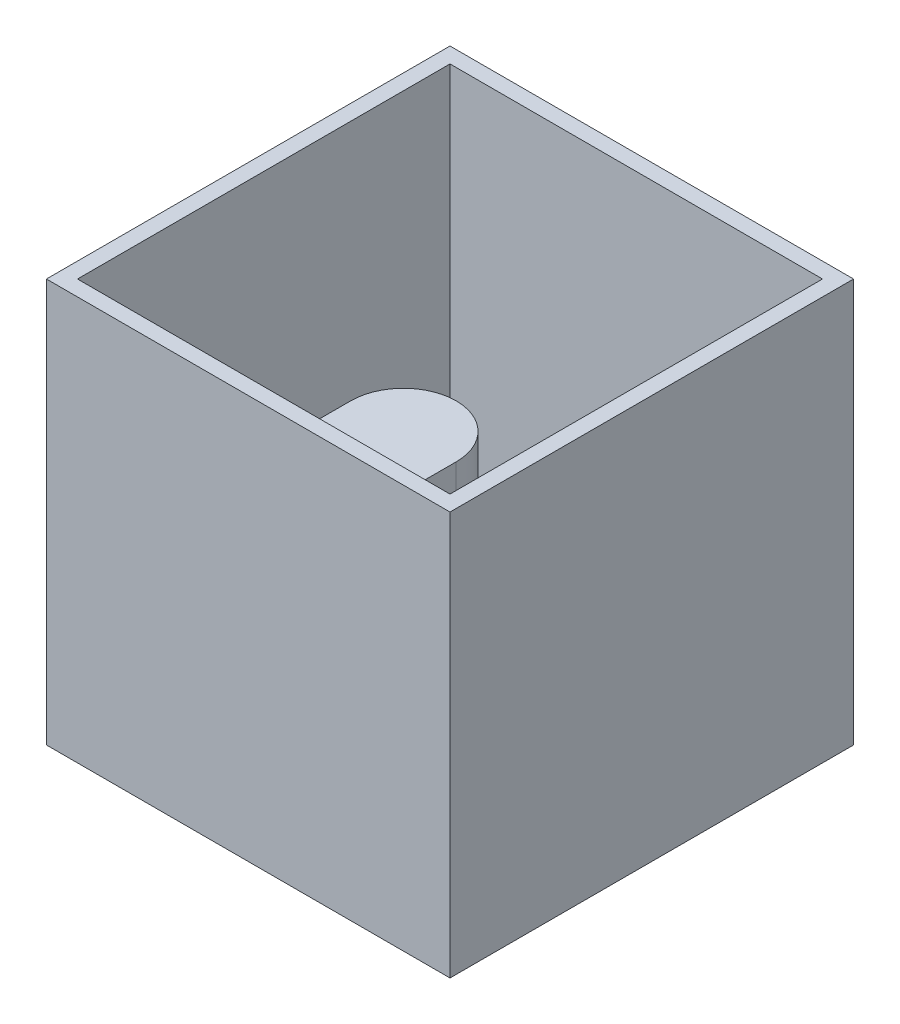
ISO-10303-21;
HEADER;
FILE_DESCRIPTION(('STEP AP214'),'2;1');
FILE_NAME('part.step','',(''),(''),'','','');
FILE_SCHEMA(('AUTOMOTIVE_DESIGN { 1 0 10303 214 1 1 1 1 }'));
ENDSEC;
DATA;
#1=APPLICATION_CONTEXT('core data for automotive mechanical design processes');
#2=APPLICATION_PROTOCOL_DEFINITION('international standard','automotive_design',2000,#1);
#3=PRODUCT_CONTEXT('',#1,'mechanical');
#4=PRODUCT('Part','Part','',(#3));
#5=PRODUCT_RELATED_PRODUCT_CATEGORY('part','',(#4));
#6=PRODUCT_DEFINITION_FORMATION('','',#4);
#7=PRODUCT_DEFINITION_CONTEXT('part definition',#1,'design');
#8=PRODUCT_DEFINITION('design','',#6,#7);
#9=PRODUCT_DEFINITION_SHAPE('','',#8);
#10=(LENGTH_UNIT() NAMED_UNIT(*) SI_UNIT(.MILLI.,.METRE.));
#11=(NAMED_UNIT(*) PLANE_ANGLE_UNIT() SI_UNIT($,.RADIAN.));
#12=(NAMED_UNIT(*) SI_UNIT($,.STERADIAN.) SOLID_ANGLE_UNIT());
#13=UNCERTAINTY_MEASURE_WITH_UNIT(LENGTH_MEASURE(1.E-05),#10,'distance_accuracy_value','');
#14=(GEOMETRIC_REPRESENTATION_CONTEXT(3) GLOBAL_UNCERTAINTY_ASSIGNED_CONTEXT((#13)) GLOBAL_UNIT_ASSIGNED_CONTEXT((#10,
#11,#12)) REPRESENTATION_CONTEXT('',''));
#15=CARTESIAN_POINT('',(0.,0.,0.));
#16=DIRECTION('',(0.,0.,1.));
#17=DIRECTION('',(1.,0.,0.));
#18=AXIS2_PLACEMENT_3D('',#15,#16,#17);
#19=CARTESIAN_POINT('',(0.,1.,0.));
#20=DIRECTION('',(0.,1.,0.));
#21=DIRECTION('',(0.,0.,1.));
#22=AXIS2_PLACEMENT_3D('',#19,#20,#21);
#23=PLANE('',#22);
#24=DIRECTION('',(1.,0.,0.));
#25=VECTOR('',#24,1.);
#26=CARTESIAN_POINT('',(0.,1.,5.84487474981654));
#27=LINE('',#26,#25);
#28=CARTESIAN_POINT('',(5.499999952,1.,5.84487474981654));
#29=VERTEX_POINT('',#28);
#30=CARTESIAN_POINT('',(9.499999952,1.,5.84487474981654));
#31=VERTEX_POINT('',#30);
#32=EDGE_CURVE('E324',#29,#31,#27,.T.);
#33=ORIENTED_EDGE('',*,*,#32,.T.);
#34=CARTESIAN_POINT('',(6.04891316665253,1.,-13.8551252501835));
#35=DIRECTION('',(0.,1.,0.));
#36=DIRECTION('',(0.,0.,1.));
#37=AXIS2_PLACEMENT_3D('',#34,#35,#36);
#38=CIRCLE('',#37,20.);
#39=CARTESIAN_POINT('',(6.04891316665253,1.,6.14487474981654));
#40=VERTEX_POINT('',#39);
#41=EDGE_CURVE('E43',#31,#40,#38,.F.);
#42=ORIENTED_EDGE('',*,*,#41,.T.);
#43=DIRECTION('',(1.,0.,0.));
#44=VECTOR('',#43,1.);
#45=CARTESIAN_POINT('',(0.,1.,6.14487474981654));
#46=LINE('',#45,#44);
#47=CARTESIAN_POINT('',(5.199999952,1.,6.14487474981654));
#48=VERTEX_POINT('',#47);
#49=EDGE_CURVE('E283',#48,#40,#46,.T.);
#50=ORIENTED_EDGE('',*,*,#49,.F.);
#51=DIRECTION('',(0.,0.,1.));
#52=VECTOR('',#51,1.);
#53=CARTESIAN_POINT('',(5.199999952,1.,0.));
#54=LINE('',#53,#52);
#55=CARTESIAN_POINT('',(5.199999952,1.,5.84144096362461));
#56=VERTEX_POINT('',#55);
#57=EDGE_CURVE('E280',#56,#48,#54,.T.);
#58=ORIENTED_EDGE('',*,*,#57,.F.);
#59=CARTESIAN_POINT('',(2.499999952,1.,5.84144096362461));
#60=DIRECTION('',(0.,-1.,0.));
#61=DIRECTION('',(0.,0.,-1.));
#62=AXIS2_PLACEMENT_3D('',#59,#60,#61);
#63=CIRCLE('',#62,2.7);
#64=CARTESIAN_POINT('',(-0.200000048,1.,5.84144096362461));
#65=VERTEX_POINT('',#64);
#66=EDGE_CURVE('E277',#65,#56,#63,.T.);
#67=ORIENTED_EDGE('',*,*,#66,.F.);
#68=DIRECTION('',(0.,0.,-1.));
#69=VECTOR('',#68,1.);
#70=CARTESIAN_POINT('',(-0.200000047999999,1.,0.));
#71=LINE('',#70,#69);
#72=CARTESIAN_POINT('',(-0.200000048,1.,7.84144096362461));
#73=VERTEX_POINT('',#72);
#74=EDGE_CURVE('E274',#73,#65,#71,.T.);
#75=ORIENTED_EDGE('',*,*,#74,.F.);
#76=CARTESIAN_POINT('',(2.499999952,1.,7.84144096362461));
#77=DIRECTION('',(0.,-1.,0.));
#78=DIRECTION('',(0.,0.,-1.));
#79=AXIS2_PLACEMENT_3D('',#76,#77,#78);
#80=CIRCLE('',#79,2.7);
#81=CARTESIAN_POINT('',(5.199999952,1.,7.84144096362461));
#82=VERTEX_POINT('',#81);
#83=EDGE_CURVE('E271',#82,#73,#80,.T.);
#84=ORIENTED_EDGE('',*,*,#83,.F.);
#85=DIRECTION('',(0.,0.,1.));
#86=VECTOR('',#85,1.);
#87=CARTESIAN_POINT('',(5.199999952,1.,0.));
#88=LINE('',#87,#86);
#89=CARTESIAN_POINT('',(5.199999952,1.,7.29891537461033));
#90=VERTEX_POINT('',#89);
#91=EDGE_CURVE('E267',#90,#82,#88,.T.);
#92=ORIENTED_EDGE('',*,*,#91,.F.);
#93=DIRECTION('',(1.,0.,0.));
#94=VECTOR('',#93,1.);
#95=CARTESIAN_POINT('',(0.,1.,7.29891537461033));
#96=LINE('',#95,#94);
#97=CARTESIAN_POINT('',(6.04891316665253,1.,7.29891537461033));
#98=VERTEX_POINT('',#97);
#99=EDGE_CURVE('E264',#90,#98,#96,.T.);
#100=ORIENTED_EDGE('',*,*,#99,.T.);
#101=CARTESIAN_POINT('',(6.04891316665253,1.,27.2989153746103));
#102=DIRECTION('',(0.,1.,0.));
#103=DIRECTION('',(0.,0.,1.));
#104=AXIS2_PLACEMENT_3D('',#101,#102,#103);
#105=CIRCLE('',#104,20.);
#106=CARTESIAN_POINT('',(9.499999952,1.,7.59891537461033));
#107=VERTEX_POINT('',#106);
#108=EDGE_CURVE('E446',#98,#107,#105,.F.);
#109=ORIENTED_EDGE('',*,*,#108,.T.);
#110=DIRECTION('',(1.,0.,0.));
#111=VECTOR('',#110,1.);
#112=CARTESIAN_POINT('',(0.,1.,7.59891537461033));
#113=LINE('',#112,#111);
#114=CARTESIAN_POINT('',(5.499999952,1.,7.59891537461033));
#115=VERTEX_POINT('',#114);
#116=EDGE_CURVE('E321',#115,#107,#113,.T.);
#117=ORIENTED_EDGE('',*,*,#116,.F.);
#118=DIRECTION('',(0.,0.,1.));
#119=VECTOR('',#118,1.);
#120=CARTESIAN_POINT('',(5.499999952,1.,0.));
#121=LINE('',#120,#119);
#122=CARTESIAN_POINT('',(5.499999952,1.,7.84144096362461));
#123=VERTEX_POINT('',#122);
#124=EDGE_CURVE('E318',#115,#123,#121,.T.);
#125=ORIENTED_EDGE('',*,*,#124,.T.);
#126=CARTESIAN_POINT('',(2.499999952,1.,7.84144096362461));
#127=DIRECTION('',(0.,1.,0.));
#128=DIRECTION('',(0.,0.,1.));
#129=AXIS2_PLACEMENT_3D('',#126,#127,#128);
#130=CIRCLE('',#129,3.);
#131=CARTESIAN_POINT('',(2.499999952,1.,10.8414409636246));
#132=VERTEX_POINT('',#131);
#133=EDGE_CURVE('E423',#123,#132,#130,.F.);
#134=ORIENTED_EDGE('',*,*,#133,.T.);
#135=CARTESIAN_POINT('',(2.499999952,1.,7.84144096362461));
#136=DIRECTION('',(0.,1.,0.));
#137=DIRECTION('',(0.,0.,1.));
#138=AXIS2_PLACEMENT_3D('',#135,#136,#137);
#139=CIRCLE('',#138,3.);
#140=CARTESIAN_POINT('',(-0.500000048,1.,7.84144096362461));
#141=VERTEX_POINT('',#140);
#142=EDGE_CURVE('E427',#132,#141,#139,.F.);
#143=ORIENTED_EDGE('',*,*,#142,.T.);
#144=DIRECTION('',(0.,0.,1.));
#145=VECTOR('',#144,1.);
#146=CARTESIAN_POINT('',(-0.500000048000001,1.,0.));
#147=LINE('',#146,#145);
#148=CARTESIAN_POINT('',(-0.500000048,1.,5.84144096362461));
#149=VERTEX_POINT('',#148);
#150=EDGE_CURVE('E316',#149,#141,#147,.T.);
#151=ORIENTED_EDGE('',*,*,#150,.F.);
#152=CARTESIAN_POINT('',(2.499999952,1.,5.84144096362461));
#153=DIRECTION('',(0.,1.,0.));
#154=DIRECTION('',(0.,0.,1.));
#155=AXIS2_PLACEMENT_3D('',#152,#153,#154);
#156=CIRCLE('',#155,3.);
#157=CARTESIAN_POINT('',(2.499999952,1.,2.84144096362461));
#158=VERTEX_POINT('',#157);
#159=EDGE_CURVE('E431',#149,#158,#156,.F.);
#160=ORIENTED_EDGE('',*,*,#159,.T.);
#161=CARTESIAN_POINT('',(2.499999952,1.,5.84144096362461));
#162=DIRECTION('',(0.,1.,0.));
#163=DIRECTION('',(0.,0.,1.));
#164=AXIS2_PLACEMENT_3D('',#161,#162,#163);
#165=CIRCLE('',#164,3.);
#166=CARTESIAN_POINT('',(5.499999952,1.,5.84144096362461));
#167=VERTEX_POINT('',#166);
#168=EDGE_CURVE('E435',#158,#167,#165,.F.);
#169=ORIENTED_EDGE('',*,*,#168,.T.);
#170=EDGE_CURVE('E314',#167,#29,#121,.T.);
#171=ORIENTED_EDGE('',*,*,#170,.T.);
#172=EDGE_LOOP('',(#33,#42,#50,#58,#67,#75,#84,#92,#100,#109,#117,#125,#134,#143,#151,#160,#169,#171));
#173=FACE_BOUND('',#172,.T.);
#174=DIRECTION('',(1.,0.,0.));
#175=VECTOR('',#174,1.);
#176=CARTESIAN_POINT('',(0.,1.,12.8414409636246));
#177=LINE('',#176,#175);
#178=CARTESIAN_POINT('',(-1.,1.,12.8414409636246));
#179=VERTEX_POINT('',#178);
#180=CARTESIAN_POINT('',(11.,1.,12.8414409636246));
#181=VERTEX_POINT('',#180);
#182=EDGE_CURVE('E348',#179,#181,#177,.T.);
#183=ORIENTED_EDGE('',*,*,#182,.T.);
#184=DIRECTION('',(0.,0.,-1.));
#185=VECTOR('',#184,1.);
#186=CARTESIAN_POINT('',(11.,1.,0.));
#187=LINE('',#186,#185);
#188=CARTESIAN_POINT('',(11.,1.,0.841440963624613));
#189=VERTEX_POINT('',#188);
#190=EDGE_CURVE('E350',#181,#189,#187,.T.);
#191=ORIENTED_EDGE('',*,*,#190,.T.);
#192=DIRECTION('',(1.,0.,0.));
#193=VECTOR('',#192,1.);
#194=CARTESIAN_POINT('',(0.,1.,0.841440963624613));
#195=LINE('',#194,#193);
#196=CARTESIAN_POINT('',(-1.,1.,0.841440963624613));
#197=VERTEX_POINT('',#196);
#198=EDGE_CURVE('E352',#197,#189,#195,.T.);
#199=ORIENTED_EDGE('',*,*,#198,.F.);
#200=DIRECTION('',(0.,0.,-1.));
#201=VECTOR('',#200,1.);
#202=CARTESIAN_POINT('',(-1.,1.,0.));
#203=LINE('',#202,#201);
#204=EDGE_CURVE('E355',#179,#197,#203,.T.);
#205=ORIENTED_EDGE('',*,*,#204,.F.);
#206=EDGE_LOOP('',(#183,#191,#199,#205));
#207=FACE_BOUND('',#206,.T.);
#208=DIRECTION('',(0.,0.,1.));
#209=VECTOR('',#208,1.);
#210=CARTESIAN_POINT('',(0.799999952,1.,5.84144096362461));
#211=LINE('',#210,#209);
#212=CARTESIAN_POINT('',(0.799999952,1.,5.84144096362461));
#213=VERTEX_POINT('',#212);
#214=CARTESIAN_POINT('',(0.799999952,1.,7.84144096362461));
#215=VERTEX_POINT('',#214);
#216=EDGE_CURVE('E868',#213,#215,#211,.T.);
#217=ORIENTED_EDGE('',*,*,#216,.F.);
#218=CARTESIAN_POINT('',(2.499999952,1.,5.84144096362461));
#219=DIRECTION('',(0.,1.,0.));
#220=DIRECTION('',(0.,0.,1.));
#221=AXIS2_PLACEMENT_3D('',#218,#219,#220);
#222=CIRCLE('',#221,1.7);
#223=CARTESIAN_POINT('',(4.199999952,1.,5.84144096362461));
#224=VERTEX_POINT('',#223);
#225=EDGE_CURVE('E254',#224,#213,#222,.T.);
#226=ORIENTED_EDGE('',*,*,#225,.F.);
#227=DIRECTION('',(0.,0.,-1.));
#228=VECTOR('',#227,1.);
#229=CARTESIAN_POINT('',(4.199999952,1.,5.84144096362461));
#230=LINE('',#229,#228);
#231=CARTESIAN_POINT('',(4.199999952,1.,7.84144096362461));
#232=VERTEX_POINT('',#231);
#233=EDGE_CURVE('E250',#232,#224,#230,.T.);
#234=ORIENTED_EDGE('',*,*,#233,.F.);
#235=CARTESIAN_POINT('',(2.499999952,1.,7.84144096362461));
#236=DIRECTION('',(0.,1.,0.));
#237=DIRECTION('',(0.,0.,1.));
#238=AXIS2_PLACEMENT_3D('',#235,#236,#237);
#239=CIRCLE('',#238,1.7);
#240=EDGE_CURVE('E865',#215,#232,#239,.T.);
#241=ORIENTED_EDGE('',*,*,#240,.F.);
#242=EDGE_LOOP('',(#217,#226,#234,#241));
#243=FACE_BOUND('',#242,.T.);
#244=ADVANCED_FACE('F35',(#173,#207,#243),#23,.T.);
#245=CARTESIAN_POINT('',(11.,13.,0.));
#246=DIRECTION('',(-1.,0.,0.));
#247=DIRECTION('',(0.,0.,1.));
#248=AXIS2_PLACEMENT_3D('',#245,#246,#247);
#249=PLANE('',#248);
#250=ORIENTED_EDGE('',*,*,#190,.F.);
#251=DIRECTION('',(0.,-1.,0.));
#252=VECTOR('',#251,1.);
#253=CARTESIAN_POINT('',(11.,13.,12.8414409636246));
#254=LINE('',#253,#252);
#255=CARTESIAN_POINT('',(11.,13.,12.8414409636246));
#256=VERTEX_POINT('',#255);
#257=EDGE_CURVE('E401',#256,#181,#254,.T.);
#258=ORIENTED_EDGE('',*,*,#257,.F.);
#259=DIRECTION('',(0.,0.,-1.));
#260=VECTOR('',#259,1.);
#261=CARTESIAN_POINT('',(11.,13.,0.));
#262=LINE('',#261,#260);
#263=CARTESIAN_POINT('',(11.,13.,0.841440963624613));
#264=VERTEX_POINT('',#263);
#265=EDGE_CURVE('E370',#256,#264,#262,.T.);
#266=ORIENTED_EDGE('',*,*,#265,.T.);
#267=DIRECTION('',(0.,-1.,0.));
#268=VECTOR('',#267,1.);
#269=CARTESIAN_POINT('',(11.,13.,0.841440963624613));
#270=LINE('',#269,#268);
#271=EDGE_CURVE('E391',#264,#189,#270,.T.);
#272=ORIENTED_EDGE('',*,*,#271,.T.);
#273=EDGE_LOOP('',(#250,#258,#266,#272));
#274=FACE_BOUND('',#273,.T.);
#275=ADVANCED_FACE('F541',(#274),#249,.T.);
#276=CARTESIAN_POINT('',(0.,13.,12.8414409636246));
#277=DIRECTION('',(0.,0.,-1.));
#278=DIRECTION('',(-1.,0.,0.));
#279=AXIS2_PLACEMENT_3D('',#276,#277,#278);
#280=PLANE('',#279);
#281=ORIENTED_EDGE('',*,*,#182,.F.);
#282=DIRECTION('',(0.,-1.,0.));
#283=VECTOR('',#282,1.);
#284=CARTESIAN_POINT('',(-1.,13.,12.8414409636246));
#285=LINE('',#284,#283);
#286=CARTESIAN_POINT('',(-1.,13.,12.8414409636246));
#287=VERTEX_POINT('',#286);
#288=EDGE_CURVE('E398',#287,#179,#285,.T.);
#289=ORIENTED_EDGE('',*,*,#288,.F.);
#290=DIRECTION('',(1.,0.,0.));
#291=VECTOR('',#290,1.);
#292=CARTESIAN_POINT('',(0.,13.,12.8414409636246));
#293=LINE('',#292,#291);
#294=EDGE_CURVE('E373',#287,#256,#293,.T.);
#295=ORIENTED_EDGE('',*,*,#294,.T.);
#296=ORIENTED_EDGE('',*,*,#257,.T.);
#297=EDGE_LOOP('',(#281,#289,#295,#296));
#298=FACE_BOUND('',#297,.T.);
#299=ADVANCED_FACE('F546',(#298),#280,.T.);
#300=CARTESIAN_POINT('',(-1.,13.,0.));
#301=DIRECTION('',(-1.,0.,0.));
#302=DIRECTION('',(0.,0.,1.));
#303=AXIS2_PLACEMENT_3D('',#300,#301,#302);
#304=PLANE('',#303);
#305=ORIENTED_EDGE('',*,*,#288,.T.);
#306=ORIENTED_EDGE('',*,*,#204,.T.);
#307=DIRECTION('',(0.,-1.,0.));
#308=VECTOR('',#307,1.);
#309=CARTESIAN_POINT('',(-1.,13.,0.841440963624613));
#310=LINE('',#309,#308);
#311=CARTESIAN_POINT('',(-1.,13.,0.841440963624613));
#312=VERTEX_POINT('',#311);
#313=EDGE_CURVE('E394',#312,#197,#310,.T.);
#314=ORIENTED_EDGE('',*,*,#313,.F.);
#315=DIRECTION('',(0.,0.,-1.));
#316=VECTOR('',#315,1.);
#317=CARTESIAN_POINT('',(-1.,13.,0.));
#318=LINE('',#317,#316);
#319=EDGE_CURVE('E376',#287,#312,#318,.T.);
#320=ORIENTED_EDGE('',*,*,#319,.F.);
#321=EDGE_LOOP('',(#305,#306,#314,#320));
#322=FACE_BOUND('',#321,.T.);
#323=ADVANCED_FACE('F563',(#322),#304,.F.);
#324=CARTESIAN_POINT('',(-1.5,13.,0.));
#325=DIRECTION('',(-1.,0.,0.));
#326=DIRECTION('',(0.,0.,1.));
#327=AXIS2_PLACEMENT_3D('',#324,#325,#326);
#328=PLANE('',#327);
#329=DIRECTION('',(0.,0.,-1.));
#330=VECTOR('',#329,1.);
#331=CARTESIAN_POINT('',(-1.5,0.,0.));
#332=LINE('',#331,#330);
#333=CARTESIAN_POINT('',(-1.5,0.,13.3414409636246));
#334=VERTEX_POINT('',#333);
#335=CARTESIAN_POINT('',(-1.5,0.,0.341440963624613));
#336=VERTEX_POINT('',#335);
#337=EDGE_CURVE('E358',#334,#336,#332,.T.);
#338=ORIENTED_EDGE('',*,*,#337,.F.);
#339=DIRECTION('',(0.,-1.,0.));
#340=VECTOR('',#339,1.);
#341=CARTESIAN_POINT('',(-1.5,13.,13.3414409636246));
#342=LINE('',#341,#340);
#343=CARTESIAN_POINT('',(-1.5,13.,13.3414409636246));
#344=VERTEX_POINT('',#343);
#345=EDGE_CURVE('E395',#344,#334,#342,.T.);
#346=ORIENTED_EDGE('',*,*,#345,.F.);
#347=DIRECTION('',(0.,0.,-1.));
#348=VECTOR('',#347,1.);
#349=CARTESIAN_POINT('',(-1.5,13.,0.));
#350=LINE('',#349,#348);
#351=CARTESIAN_POINT('',(-1.5,13.,0.341440963624613));
#352=VERTEX_POINT('',#351);
#353=EDGE_CURVE('E359',#344,#352,#350,.T.);
#354=ORIENTED_EDGE('',*,*,#353,.T.);
#355=DIRECTION('',(0.,-1.,0.));
#356=VECTOR('',#355,1.);
#357=CARTESIAN_POINT('',(-1.5,13.,0.341440963624613));
#358=LINE('',#357,#356);
#359=EDGE_CURVE('E381',#352,#336,#358,.T.);
#360=ORIENTED_EDGE('',*,*,#359,.T.);
#361=EDGE_LOOP('',(#338,#346,#354,#360));
#362=FACE_BOUND('',#361,.T.);
#363=ADVANCED_FACE('F566',(#362),#328,.T.);
#364=CARTESIAN_POINT('',(0.,13.,13.3414409636246));
#365=DIRECTION('',(0.,0.,-1.));
#366=DIRECTION('',(-1.,0.,0.));
#367=AXIS2_PLACEMENT_3D('',#364,#365,#366);
#368=PLANE('',#367);
#369=DIRECTION('',(1.,0.,0.));
#370=VECTOR('',#369,1.);
#371=CARTESIAN_POINT('',(0.,0.,13.3414409636246));
#372=LINE('',#371,#370);
#373=CARTESIAN_POINT('',(11.5,0.,13.3414409636246));
#374=VERTEX_POINT('',#373);
#375=EDGE_CURVE('E384',#334,#374,#372,.T.);
#376=ORIENTED_EDGE('',*,*,#375,.T.);
#377=DIRECTION('',(0.,-1.,0.));
#378=VECTOR('',#377,1.);
#379=CARTESIAN_POINT('',(11.5,13.,13.3414409636246));
#380=LINE('',#379,#378);
#381=CARTESIAN_POINT('',(11.5,13.,13.3414409636246));
#382=VERTEX_POINT('',#381);
#383=EDGE_CURVE('E408',#382,#374,#380,.T.);
#384=ORIENTED_EDGE('',*,*,#383,.F.);
#385=DIRECTION('',(1.,0.,0.));
#386=VECTOR('',#385,1.);
#387=CARTESIAN_POINT('',(0.,13.,13.3414409636246));
#388=LINE('',#387,#386);
#389=EDGE_CURVE('E362',#344,#382,#388,.T.);
#390=ORIENTED_EDGE('',*,*,#389,.F.);
#391=ORIENTED_EDGE('',*,*,#345,.T.);
#392=EDGE_LOOP('',(#376,#384,#390,#391));
#393=FACE_BOUND('',#392,.T.);
#394=ADVANCED_FACE('F577',(#393),#368,.F.);
#395=CARTESIAN_POINT('',(11.5,13.,0.));
#396=DIRECTION('',(-1.,0.,0.));
#397=DIRECTION('',(0.,0.,1.));
#398=AXIS2_PLACEMENT_3D('',#395,#396,#397);
#399=PLANE('',#398);
#400=DIRECTION('',(0.,0.,-1.));
#401=VECTOR('',#400,1.);
#402=CARTESIAN_POINT('',(11.5,0.,0.));
#403=LINE('',#402,#401);
#404=CARTESIAN_POINT('',(11.5,0.,0.341440963624613));
#405=VERTEX_POINT('',#404);
#406=EDGE_CURVE('E386',#374,#405,#403,.T.);
#407=ORIENTED_EDGE('',*,*,#406,.T.);
#408=DIRECTION('',(0.,-1.,0.));
#409=VECTOR('',#408,1.);
#410=CARTESIAN_POINT('',(11.5,13.,0.341440963624613));
#411=LINE('',#410,#409);
#412=CARTESIAN_POINT('',(11.5,13.,0.341440963624613));
#413=VERTEX_POINT('',#412);
#414=EDGE_CURVE('E406',#413,#405,#411,.T.);
#415=ORIENTED_EDGE('',*,*,#414,.F.);
#416=DIRECTION('',(0.,0.,-1.));
#417=VECTOR('',#416,1.);
#418=CARTESIAN_POINT('',(11.5,13.,0.));
#419=LINE('',#418,#417);
#420=EDGE_CURVE('E365',#382,#413,#419,.T.);
#421=ORIENTED_EDGE('',*,*,#420,.F.);
#422=ORIENTED_EDGE('',*,*,#383,.T.);
#423=EDGE_LOOP('',(#407,#415,#421,#422));
#424=FACE_BOUND('',#423,.T.);
#425=ADVANCED_FACE('F573',(#424),#399,.F.);
#426=CARTESIAN_POINT('',(0.,13.,0.341440963624613));
#427=DIRECTION('',(0.,0.,-1.));
#428=DIRECTION('',(-1.,0.,0.));
#429=AXIS2_PLACEMENT_3D('',#426,#427,#428);
#430=PLANE('',#429);
#431=DIRECTION('',(1.,0.,0.));
#432=VECTOR('',#431,1.);
#433=CARTESIAN_POINT('',(0.,0.,0.341440963624613));
#434=LINE('',#433,#432);
#435=EDGE_CURVE('E363',#336,#405,#434,.T.);
#436=ORIENTED_EDGE('',*,*,#435,.F.);
#437=ORIENTED_EDGE('',*,*,#359,.F.);
#438=DIRECTION('',(1.,0.,0.));
#439=VECTOR('',#438,1.);
#440=CARTESIAN_POINT('',(0.,13.,0.341440963624613));
#441=LINE('',#440,#439);
#442=EDGE_CURVE('E367',#352,#413,#441,.T.);
#443=ORIENTED_EDGE('',*,*,#442,.T.);
#444=ORIENTED_EDGE('',*,*,#414,.T.);
#445=EDGE_LOOP('',(#436,#437,#443,#444));
#446=FACE_BOUND('',#445,.T.);
#447=ADVANCED_FACE('F561',(#446),#430,.T.);
#448=CARTESIAN_POINT('',(0.,13.,0.841440963624613));
#449=DIRECTION('',(0.,0.,-1.));
#450=DIRECTION('',(-1.,0.,0.));
#451=AXIS2_PLACEMENT_3D('',#448,#449,#450);
#452=PLANE('',#451);
#453=ORIENTED_EDGE('',*,*,#313,.T.);
#454=ORIENTED_EDGE('',*,*,#198,.T.);
#455=ORIENTED_EDGE('',*,*,#271,.F.);
#456=DIRECTION('',(1.,0.,0.));
#457=VECTOR('',#456,1.);
#458=CARTESIAN_POINT('',(0.,13.,0.841440963624613));
#459=LINE('',#458,#457);
#460=EDGE_CURVE('E379',#312,#264,#459,.T.);
#461=ORIENTED_EDGE('',*,*,#460,.F.);
#462=EDGE_LOOP('',(#453,#454,#455,#461));
#463=FACE_BOUND('',#462,.T.);
#464=ADVANCED_FACE('F555',(#463),#452,.F.);
#465=CARTESIAN_POINT('',(0.,13.,0.));
#466=DIRECTION('',(0.,1.,0.));
#467=DIRECTION('',(0.,0.,1.));
#468=AXIS2_PLACEMENT_3D('',#465,#466,#467);
#469=PLANE('',#468);
#470=ORIENTED_EDGE('',*,*,#353,.F.);
#471=ORIENTED_EDGE('',*,*,#389,.T.);
#472=ORIENTED_EDGE('',*,*,#420,.T.);
#473=ORIENTED_EDGE('',*,*,#442,.F.);
#474=EDGE_LOOP('',(#470,#471,#472,#473));
#475=FACE_BOUND('',#474,.T.);
#476=ORIENTED_EDGE('',*,*,#265,.F.);
#477=ORIENTED_EDGE('',*,*,#294,.F.);
#478=ORIENTED_EDGE('',*,*,#319,.T.);
#479=ORIENTED_EDGE('',*,*,#460,.T.);
#480=EDGE_LOOP('',(#476,#477,#478,#479));
#481=FACE_BOUND('',#480,.T.);
#482=ADVANCED_FACE('F552',(#475,#481),#469,.T.);
#483=CARTESIAN_POINT('',(0.,0.,0.));
#484=DIRECTION('',(0.,1.,0.));
#485=DIRECTION('',(0.,0.,1.));
#486=AXIS2_PLACEMENT_3D('',#483,#484,#485);
#487=PLANE('',#486);
#488=DIRECTION('',(1.,0.,0.));
#489=VECTOR('',#488,1.);
#490=CARTESIAN_POINT('',(0.,0.,6.14487474981654));
#491=LINE('',#490,#489);
#492=CARTESIAN_POINT('',(5.199999952,0.,6.14487474981654));
#493=VERTEX_POINT('',#492);
#494=CARTESIAN_POINT('',(6.04891316665253,0.,6.14487474981654));
#495=VERTEX_POINT('',#494);
#496=EDGE_CURVE('E268',#493,#495,#491,.T.);
#497=ORIENTED_EDGE('',*,*,#496,.T.);
#498=CARTESIAN_POINT('',(6.04891316665253,0.,-13.8551252501835));
#499=DIRECTION('',(0.,1.,0.));
#500=DIRECTION('',(0.,0.,1.));
#501=AXIS2_PLACEMENT_3D('',#498,#499,#500);
#502=CIRCLE('',#501,20.);
#503=CARTESIAN_POINT('',(9.499999952,0.,5.84487474981654));
#504=VERTEX_POINT('',#503);
#505=EDGE_CURVE('E11',#495,#504,#502,.T.);
#506=ORIENTED_EDGE('',*,*,#505,.T.);
#507=DIRECTION('',(1.,0.,0.));
#508=VECTOR('',#507,1.);
#509=CARTESIAN_POINT('',(0.,0.,5.84487474981654));
#510=LINE('',#509,#508);
#511=CARTESIAN_POINT('',(5.499999952,0.,5.84487474981654));
#512=VERTEX_POINT('',#511);
#513=EDGE_CURVE('E317',#512,#504,#510,.T.);
#514=ORIENTED_EDGE('',*,*,#513,.F.);
#515=DIRECTION('',(0.,0.,1.));
#516=VECTOR('',#515,1.);
#517=CARTESIAN_POINT('',(5.499999952,0.,0.));
#518=LINE('',#517,#516);
#519=CARTESIAN_POINT('',(5.499999952,0.,5.84144096362461));
#520=VERTEX_POINT('',#519);
#521=EDGE_CURVE('E327',#520,#512,#518,.T.);
#522=ORIENTED_EDGE('',*,*,#521,.F.);
#523=CARTESIAN_POINT('',(2.499999952,0.,5.84144096362461));
#524=DIRECTION('',(0.,1.,0.));
#525=DIRECTION('',(0.,0.,1.));
#526=AXIS2_PLACEMENT_3D('',#523,#524,#525);
#527=CIRCLE('',#526,3.);
#528=CARTESIAN_POINT('',(2.499999952,0.,2.84144096362461));
#529=VERTEX_POINT('',#528);
#530=EDGE_CURVE('E433',#520,#529,#527,.T.);
#531=ORIENTED_EDGE('',*,*,#530,.T.);
#532=CARTESIAN_POINT('',(2.499999952,0.,5.84144096362461));
#533=DIRECTION('',(0.,1.,0.));
#534=DIRECTION('',(0.,0.,1.));
#535=AXIS2_PLACEMENT_3D('',#532,#533,#534);
#536=CIRCLE('',#535,3.);
#537=CARTESIAN_POINT('',(-0.500000048,0.,5.84144096362461));
#538=VERTEX_POINT('',#537);
#539=EDGE_CURVE('E429',#529,#538,#536,.T.);
#540=ORIENTED_EDGE('',*,*,#539,.T.);
#541=DIRECTION('',(0.,0.,1.));
#542=VECTOR('',#541,1.);
#543=CARTESIAN_POINT('',(-0.500000048000001,0.,0.));
#544=LINE('',#543,#542);
#545=CARTESIAN_POINT('',(-0.500000048,0.,7.84144096362461));
#546=VERTEX_POINT('',#545);
#547=EDGE_CURVE('E329',#538,#546,#544,.T.);
#548=ORIENTED_EDGE('',*,*,#547,.T.);
#549=CARTESIAN_POINT('',(2.499999952,0.,7.84144096362461));
#550=DIRECTION('',(0.,1.,0.));
#551=DIRECTION('',(0.,0.,1.));
#552=AXIS2_PLACEMENT_3D('',#549,#550,#551);
#553=CIRCLE('',#552,3.);
#554=CARTESIAN_POINT('',(2.499999952,0.,10.8414409636246));
#555=VERTEX_POINT('',#554);
#556=EDGE_CURVE('E425',#546,#555,#553,.T.);
#557=ORIENTED_EDGE('',*,*,#556,.T.);
#558=CARTESIAN_POINT('',(2.499999952,0.,7.84144096362461));
#559=DIRECTION('',(0.,1.,0.));
#560=DIRECTION('',(0.,0.,1.));
#561=AXIS2_PLACEMENT_3D('',#558,#559,#560);
#562=CIRCLE('',#561,3.);
#563=CARTESIAN_POINT('',(5.499999952,0.,7.84144096362461));
#564=VERTEX_POINT('',#563);
#565=EDGE_CURVE('E421',#555,#564,#562,.T.);
#566=ORIENTED_EDGE('',*,*,#565,.T.);
#567=CARTESIAN_POINT('',(5.499999952,0.,7.59891537461033));
#568=VERTEX_POINT('',#567);
#569=EDGE_CURVE('E331',#568,#564,#518,.T.);
#570=ORIENTED_EDGE('',*,*,#569,.F.);
#571=DIRECTION('',(1.,0.,0.));
#572=VECTOR('',#571,1.);
#573=CARTESIAN_POINT('',(0.,0.,7.59891537461033));
#574=LINE('',#573,#572);
#575=CARTESIAN_POINT('',(9.499999952,0.,7.59891537461033));
#576=VERTEX_POINT('',#575);
#577=EDGE_CURVE('E334',#568,#576,#574,.T.);
#578=ORIENTED_EDGE('',*,*,#577,.T.);
#579=CARTESIAN_POINT('',(6.04891316665253,0.,27.2989153746103));
#580=DIRECTION('',(0.,1.,0.));
#581=DIRECTION('',(0.,0.,1.));
#582=AXIS2_PLACEMENT_3D('',#579,#580,#581);
#583=CIRCLE('',#582,20.);
#584=CARTESIAN_POINT('',(6.04891316665253,0.,7.29891537461033));
#585=VERTEX_POINT('',#584);
#586=EDGE_CURVE('E448',#576,#585,#583,.T.);
#587=ORIENTED_EDGE('',*,*,#586,.T.);
#588=DIRECTION('',(1.,0.,0.));
#589=VECTOR('',#588,1.);
#590=CARTESIAN_POINT('',(0.,0.,7.29891537461033));
#591=LINE('',#590,#589);
#592=CARTESIAN_POINT('',(5.199999952,0.,7.29891537461033));
#593=VERTEX_POINT('',#592);
#594=EDGE_CURVE('E256',#593,#585,#591,.T.);
#595=ORIENTED_EDGE('',*,*,#594,.F.);
#596=DIRECTION('',(0.,0.,1.));
#597=VECTOR('',#596,1.);
#598=CARTESIAN_POINT('',(5.199999952,0.,0.));
#599=LINE('',#598,#597);
#600=CARTESIAN_POINT('',(5.199999952,0.,7.84144096362461));
#601=VERTEX_POINT('',#600);
#602=EDGE_CURVE('E259',#593,#601,#599,.T.);
#603=ORIENTED_EDGE('',*,*,#602,.T.);
#604=CARTESIAN_POINT('',(2.499999952,0.,7.84144096362461));
#605=DIRECTION('',(0.,-1.,0.));
#606=DIRECTION('',(0.,0.,-1.));
#607=AXIS2_PLACEMENT_3D('',#604,#605,#606);
#608=CIRCLE('',#607,2.7);
#609=CARTESIAN_POINT('',(-0.200000048,0.,7.84144096362461));
#610=VERTEX_POINT('',#609);
#611=EDGE_CURVE('E288',#601,#610,#608,.T.);
#612=ORIENTED_EDGE('',*,*,#611,.T.);
#613=DIRECTION('',(0.,0.,-1.));
#614=VECTOR('',#613,1.);
#615=CARTESIAN_POINT('',(-0.200000047999999,0.,0.));
#616=LINE('',#615,#614);
#617=CARTESIAN_POINT('',(-0.200000048,0.,5.84144096362461));
#618=VERTEX_POINT('',#617);
#619=EDGE_CURVE('E291',#610,#618,#616,.T.);
#620=ORIENTED_EDGE('',*,*,#619,.T.);
#621=CARTESIAN_POINT('',(2.499999952,0.,5.84144096362461));
#622=DIRECTION('',(0.,-1.,0.));
#623=DIRECTION('',(0.,0.,-1.));
#624=AXIS2_PLACEMENT_3D('',#621,#622,#623);
#625=CIRCLE('',#624,2.7);
#626=CARTESIAN_POINT('',(5.199999952,0.,5.84144096362461));
#627=VERTEX_POINT('',#626);
#628=EDGE_CURVE('E294',#618,#627,#625,.T.);
#629=ORIENTED_EDGE('',*,*,#628,.T.);
#630=DIRECTION('',(0.,0.,1.));
#631=VECTOR('',#630,1.);
#632=CARTESIAN_POINT('',(5.199999952,0.,0.));
#633=LINE('',#632,#631);
#634=EDGE_CURVE('E297',#627,#493,#633,.T.);
#635=ORIENTED_EDGE('',*,*,#634,.T.);
#636=EDGE_LOOP('',(#497,#506,#514,#522,#531,#540,#548,#557,#566,#570,#578,#587,#595,#603,#612,
#620,#629,#635));
#637=FACE_BOUND('',#636,.T.);
#638=ORIENTED_EDGE('',*,*,#337,.T.);
#639=ORIENTED_EDGE('',*,*,#435,.T.);
#640=ORIENTED_EDGE('',*,*,#406,.F.);
#641=ORIENTED_EDGE('',*,*,#375,.F.);
#642=EDGE_LOOP('',(#638,#639,#640,#641));
#643=FACE_BOUND('',#642,.T.);
#644=ADVANCED_FACE('F452',(#637,#643),#487,.F.);
#645=CARTESIAN_POINT('',(5.499999952,1.,0.));
#646=DIRECTION('',(1.,0.,0.));
#647=DIRECTION('',(0.,0.,-1.));
#648=AXIS2_PLACEMENT_3D('',#645,#646,#647);
#649=PLANE('',#648);
#650=ORIENTED_EDGE('',*,*,#170,.F.);
#651=DIRECTION('',(0.,-1.,0.));
#652=VECTOR('',#651,1.);
#653=CARTESIAN_POINT('',(5.499999952,0.,5.84144096362461));
#654=LINE('',#653,#652);
#655=EDGE_CURVE('E419',#167,#520,#654,.T.);
#656=ORIENTED_EDGE('',*,*,#655,.T.);
#657=ORIENTED_EDGE('',*,*,#521,.T.);
#658=DIRECTION('',(0.,-1.,0.));
#659=VECTOR('',#658,1.);
#660=CARTESIAN_POINT('',(5.499999952,1.,5.84487474981654));
#661=LINE('',#660,#659);
#662=EDGE_CURVE('E326',#29,#512,#661,.T.);
#663=ORIENTED_EDGE('',*,*,#662,.F.);
#664=EDGE_LOOP('',(#650,#656,#657,#663));
#665=FACE_BOUND('',#664,.T.);
#666=ADVANCED_FACE('F501',(#665),#649,.F.);
#667=CARTESIAN_POINT('',(-0.500000048000001,1.,0.));
#668=DIRECTION('',(1.,0.,0.));
#669=DIRECTION('',(0.,0.,-1.));
#670=AXIS2_PLACEMENT_3D('',#667,#668,#669);
#671=PLANE('',#670);
#672=ORIENTED_EDGE('',*,*,#150,.T.);
#673=DIRECTION('',(0.,-1.,0.));
#674=VECTOR('',#673,1.);
#675=CARTESIAN_POINT('',(-0.500000048,0.,7.84144096362461));
#676=LINE('',#675,#674);
#677=EDGE_CURVE('E417',#141,#546,#676,.T.);
#678=ORIENTED_EDGE('',*,*,#677,.T.);
#679=ORIENTED_EDGE('',*,*,#547,.F.);
#680=DIRECTION('',(0.,-1.,0.));
#681=VECTOR('',#680,1.);
#682=CARTESIAN_POINT('',(-0.500000048,1.,5.84144096362461));
#683=LINE('',#682,#681);
#684=EDGE_CURVE('E414',#538,#149,#683,.F.);
#685=ORIENTED_EDGE('',*,*,#684,.T.);
#686=EDGE_LOOP('',(#672,#678,#679,#685));
#687=FACE_BOUND('',#686,.T.);
#688=ADVANCED_FACE('F489',(#687),#671,.T.);
#689=ORIENTED_EDGE('',*,*,#569,.T.);
#690=DIRECTION('',(0.,-1.,0.));
#691=VECTOR('',#690,1.);
#692=CARTESIAN_POINT('',(5.499999952,1.,7.84144096362461));
#693=LINE('',#692,#691);
#694=EDGE_CURVE('E404',#564,#123,#693,.F.);
#695=ORIENTED_EDGE('',*,*,#694,.T.);
#696=ORIENTED_EDGE('',*,*,#124,.F.);
#697=DIRECTION('',(0.,-1.,0.));
#698=VECTOR('',#697,1.);
#699=CARTESIAN_POINT('',(5.499999952,1.,7.59891537461033));
#700=LINE('',#699,#698);
#701=EDGE_CURVE('E346',#115,#568,#700,.T.);
#702=ORIENTED_EDGE('',*,*,#701,.T.);
#703=EDGE_LOOP('',(#689,#695,#696,#702));
#704=FACE_BOUND('',#703,.T.);
#705=ADVANCED_FACE('F473',(#704),#649,.F.);
#706=CARTESIAN_POINT('',(0.,1.,7.59891537461033));
#707=DIRECTION('',(0.,0.,-1.));
#708=DIRECTION('',(-1.,0.,0.));
#709=AXIS2_PLACEMENT_3D('',#706,#707,#708);
#710=PLANE('',#709);
#711=ORIENTED_EDGE('',*,*,#577,.F.);
#712=ORIENTED_EDGE('',*,*,#701,.F.);
#713=ORIENTED_EDGE('',*,*,#116,.T.);
#714=DIRECTION('',(0.,-1.,0.));
#715=VECTOR('',#714,1.);
#716=CARTESIAN_POINT('',(9.499999952,1.,7.59891537461033));
#717=LINE('',#716,#715);
#718=EDGE_CURVE('E344',#107,#576,#717,.T.);
#719=ORIENTED_EDGE('',*,*,#718,.T.);
#720=EDGE_LOOP('',(#711,#712,#713,#719));
#721=FACE_BOUND('',#720,.T.);
#722=ADVANCED_FACE('F469',(#721),#710,.T.);
#723=CARTESIAN_POINT('',(0.,1.,5.84487474981654));
#724=DIRECTION('',(0.,0.,-1.));
#725=DIRECTION('',(-1.,0.,0.));
#726=AXIS2_PLACEMENT_3D('',#723,#724,#725);
#727=PLANE('',#726);
#728=ORIENTED_EDGE('',*,*,#513,.T.);
#729=DIRECTION('',(0.,-1.,0.));
#730=VECTOR('',#729,1.);
#731=CARTESIAN_POINT('',(9.499999952,1.,5.84487474981654));
#732=LINE('',#731,#730);
#733=EDGE_CURVE('E341',#31,#504,#732,.T.);
#734=ORIENTED_EDGE('',*,*,#733,.F.);
#735=ORIENTED_EDGE('',*,*,#32,.F.);
#736=ORIENTED_EDGE('',*,*,#662,.T.);
#737=EDGE_LOOP('',(#728,#734,#735,#736));
#738=FACE_BOUND('',#737,.T.);
#739=ADVANCED_FACE('F507',(#738),#727,.F.);
#740=CARTESIAN_POINT('',(2.499999952,1.,7.84144096362461));
#741=DIRECTION('',(0.,1.,0.));
#742=DIRECTION('',(0.,0.,1.));
#743=AXIS2_PLACEMENT_3D('',#740,#741,#742);
#744=CYLINDRICAL_SURFACE('',#743,3.);
#745=ORIENTED_EDGE('',*,*,#677,.F.);
#746=ORIENTED_EDGE('',*,*,#142,.F.);
#747=DIRECTION('',(0.,-1.,0.));
#748=VECTOR('',#747,1.);
#749=CARTESIAN_POINT('',(2.499999952,1.,10.8414409636246));
#750=LINE('',#749,#748);
#751=EDGE_CURVE('E330',#555,#132,#750,.F.);
#752=ORIENTED_EDGE('',*,*,#751,.F.);
#753=ORIENTED_EDGE('',*,*,#556,.F.);
#754=EDGE_LOOP('',(#745,#746,#752,#753));
#755=FACE_BOUND('',#754,.T.);
#756=ADVANCED_FACE('F481',(#755),#744,.F.);
#757=CARTESIAN_POINT('',(2.499999952,1.,7.84144096362461));
#758=DIRECTION('',(0.,-1.,0.));
#759=DIRECTION('',(0.,0.,-1.));
#760=AXIS2_PLACEMENT_3D('',#757,#758,#759);
#761=CYLINDRICAL_SURFACE('',#760,3.);
#762=ORIENTED_EDGE('',*,*,#133,.F.);
#763=ORIENTED_EDGE('',*,*,#694,.F.);
#764=ORIENTED_EDGE('',*,*,#565,.F.);
#765=ORIENTED_EDGE('',*,*,#751,.T.);
#766=EDGE_LOOP('',(#762,#763,#764,#765));
#767=FACE_BOUND('',#766,.T.);
#768=ADVANCED_FACE('F484',(#767),#761,.F.);
#769=CARTESIAN_POINT('',(2.499999952,1.,5.84144096362461));
#770=DIRECTION('',(0.,1.,0.));
#771=DIRECTION('',(0.,0.,1.));
#772=AXIS2_PLACEMENT_3D('',#769,#770,#771);
#773=CYLINDRICAL_SURFACE('',#772,3.);
#774=ORIENTED_EDGE('',*,*,#655,.F.);
#775=ORIENTED_EDGE('',*,*,#168,.F.);
#776=DIRECTION('',(0.,-1.,0.));
#777=VECTOR('',#776,1.);
#778=CARTESIAN_POINT('',(2.499999952,1.,2.84144096362461));
#779=LINE('',#778,#777);
#780=EDGE_CURVE('E304',#529,#158,#779,.F.);
#781=ORIENTED_EDGE('',*,*,#780,.F.);
#782=ORIENTED_EDGE('',*,*,#530,.F.);
#783=EDGE_LOOP('',(#774,#775,#781,#782));
#784=FACE_BOUND('',#783,.T.);
#785=ADVANCED_FACE('F497',(#784),#773,.F.);
#786=CARTESIAN_POINT('',(2.499999952,1.,5.84144096362461));
#787=DIRECTION('',(0.,-1.,0.));
#788=DIRECTION('',(0.,0.,-1.));
#789=AXIS2_PLACEMENT_3D('',#786,#787,#788);
#790=CYLINDRICAL_SURFACE('',#789,3.);
#791=ORIENTED_EDGE('',*,*,#159,.F.);
#792=ORIENTED_EDGE('',*,*,#684,.F.);
#793=ORIENTED_EDGE('',*,*,#539,.F.);
#794=ORIENTED_EDGE('',*,*,#780,.T.);
#795=EDGE_LOOP('',(#791,#792,#793,#794));
#796=FACE_BOUND('',#795,.T.);
#797=ADVANCED_FACE('F491',(#796),#790,.F.);
#798=CARTESIAN_POINT('',(0.,1.,6.14487474981654));
#799=DIRECTION('',(0.,0.,-1.));
#800=DIRECTION('',(-1.,0.,0.));
#801=AXIS2_PLACEMENT_3D('',#798,#799,#800);
#802=PLANE('',#801);
#803=ORIENTED_EDGE('',*,*,#49,.T.);
#804=DIRECTION('',(0.,-1.,0.));
#805=VECTOR('',#804,1.);
#806=CARTESIAN_POINT('',(6.04891316665253,0.,6.14487474981654));
#807=LINE('',#806,#805);
#808=EDGE_CURVE('E444',#40,#495,#807,.T.);
#809=ORIENTED_EDGE('',*,*,#808,.T.);
#810=ORIENTED_EDGE('',*,*,#496,.F.);
#811=DIRECTION('',(0.,-1.,0.));
#812=VECTOR('',#811,1.);
#813=CARTESIAN_POINT('',(5.199999952,1.,6.14487474981654));
#814=LINE('',#813,#812);
#815=EDGE_CURVE('E302',#48,#493,#814,.T.);
#816=ORIENTED_EDGE('',*,*,#815,.F.);
#817=EDGE_LOOP('',(#803,#809,#810,#816));
#818=FACE_BOUND('',#817,.T.);
#819=ADVANCED_FACE('F513',(#818),#802,.T.);
#820=CARTESIAN_POINT('',(0.,1.,7.29891537461033));
#821=DIRECTION('',(0.,0.,-1.));
#822=DIRECTION('',(-1.,0.,0.));
#823=AXIS2_PLACEMENT_3D('',#820,#821,#822);
#824=PLANE('',#823);
#825=ORIENTED_EDGE('',*,*,#594,.T.);
#826=DIRECTION('',(0.,1.,0.));
#827=VECTOR('',#826,1.);
#828=CARTESIAN_POINT('',(6.04891316665253,1.,7.29891537461033));
#829=LINE('',#828,#827);
#830=EDGE_CURVE('E437',#585,#98,#829,.T.);
#831=ORIENTED_EDGE('',*,*,#830,.T.);
#832=ORIENTED_EDGE('',*,*,#99,.F.);
#833=DIRECTION('',(0.,-1.,0.));
#834=VECTOR('',#833,1.);
#835=CARTESIAN_POINT('',(5.199999952,1.,7.29891537461033));
#836=LINE('',#835,#834);
#837=EDGE_CURVE('E284',#90,#593,#836,.T.);
#838=ORIENTED_EDGE('',*,*,#837,.T.);
#839=EDGE_LOOP('',(#825,#831,#832,#838));
#840=FACE_BOUND('',#839,.T.);
#841=ADVANCED_FACE('F461',(#840),#824,.F.);
#842=CARTESIAN_POINT('',(5.199999952,1.,0.));
#843=DIRECTION('',(1.,0.,0.));
#844=DIRECTION('',(0.,0.,-1.));
#845=AXIS2_PLACEMENT_3D('',#842,#843,#844);
#846=PLANE('',#845);
#847=ORIENTED_EDGE('',*,*,#634,.F.);
#848=DIRECTION('',(0.,-1.,0.));
#849=VECTOR('',#848,1.);
#850=CARTESIAN_POINT('',(5.199999952,1.,5.84144096362461));
#851=LINE('',#850,#849);
#852=EDGE_CURVE('E305',#56,#627,#851,.T.);
#853=ORIENTED_EDGE('',*,*,#852,.F.);
#854=ORIENTED_EDGE('',*,*,#57,.T.);
#855=ORIENTED_EDGE('',*,*,#815,.T.);
#856=EDGE_LOOP('',(#847,#853,#854,#855));
#857=FACE_BOUND('',#856,.T.);
#858=ADVANCED_FACE('F517',(#857),#846,.T.);
#859=CARTESIAN_POINT('',(2.499999952,1.,5.84144096362461));
#860=DIRECTION('',(0.,-1.,0.));
#861=DIRECTION('',(0.,0.,-1.));
#862=AXIS2_PLACEMENT_3D('',#859,#860,#861);
#863=CYLINDRICAL_SURFACE('',#862,2.7);
#864=ORIENTED_EDGE('',*,*,#628,.F.);
#865=DIRECTION('',(0.,-1.,0.));
#866=VECTOR('',#865,1.);
#867=CARTESIAN_POINT('',(-0.200000048,1.,5.84144096362461));
#868=LINE('',#867,#866);
#869=EDGE_CURVE('E307',#65,#618,#868,.T.);
#870=ORIENTED_EDGE('',*,*,#869,.F.);
#871=ORIENTED_EDGE('',*,*,#66,.T.);
#872=ORIENTED_EDGE('',*,*,#852,.T.);
#873=EDGE_LOOP('',(#864,#870,#871,#872));
#874=FACE_BOUND('',#873,.T.);
#875=ADVANCED_FACE('F522',(#874),#863,.T.);
#876=CARTESIAN_POINT('',(-0.200000047999999,1.,0.));
#877=DIRECTION('',(-1.,0.,0.));
#878=DIRECTION('',(0.,0.,1.));
#879=AXIS2_PLACEMENT_3D('',#876,#877,#878);
#880=PLANE('',#879);
#881=ORIENTED_EDGE('',*,*,#619,.F.);
#882=DIRECTION('',(0.,-1.,0.));
#883=VECTOR('',#882,1.);
#884=CARTESIAN_POINT('',(-0.200000048,1.,7.84144096362461));
#885=LINE('',#884,#883);
#886=EDGE_CURVE('E309',#73,#610,#885,.T.);
#887=ORIENTED_EDGE('',*,*,#886,.F.);
#888=ORIENTED_EDGE('',*,*,#74,.T.);
#889=ORIENTED_EDGE('',*,*,#869,.T.);
#890=EDGE_LOOP('',(#881,#887,#888,#889));
#891=FACE_BOUND('',#890,.T.);
#892=ADVANCED_FACE('F525',(#891),#880,.T.);
#893=CARTESIAN_POINT('',(2.499999952,1.,7.84144096362461));
#894=DIRECTION('',(0.,-1.,0.));
#895=DIRECTION('',(0.,0.,-1.));
#896=AXIS2_PLACEMENT_3D('',#893,#894,#895);
#897=CYLINDRICAL_SURFACE('',#896,2.7);
#898=ORIENTED_EDGE('',*,*,#611,.F.);
#899=DIRECTION('',(0.,-1.,0.));
#900=VECTOR('',#899,1.);
#901=CARTESIAN_POINT('',(5.199999952,1.,7.84144096362461));
#902=LINE('',#901,#900);
#903=EDGE_CURVE('E311',#82,#601,#902,.T.);
#904=ORIENTED_EDGE('',*,*,#903,.F.);
#905=ORIENTED_EDGE('',*,*,#83,.T.);
#906=ORIENTED_EDGE('',*,*,#886,.T.);
#907=EDGE_LOOP('',(#898,#904,#905,#906));
#908=FACE_BOUND('',#907,.T.);
#909=ADVANCED_FACE('F529',(#908),#897,.T.);
#910=CARTESIAN_POINT('',(5.199999952,1.,0.));
#911=DIRECTION('',(1.,0.,0.));
#912=DIRECTION('',(0.,0.,-1.));
#913=AXIS2_PLACEMENT_3D('',#910,#911,#912);
#914=PLANE('',#913);
#915=ORIENTED_EDGE('',*,*,#602,.F.);
#916=ORIENTED_EDGE('',*,*,#837,.F.);
#917=ORIENTED_EDGE('',*,*,#91,.T.);
#918=ORIENTED_EDGE('',*,*,#903,.T.);
#919=EDGE_LOOP('',(#915,#916,#917,#918));
#920=FACE_BOUND('',#919,.T.);
#921=ADVANCED_FACE('F531',(#920),#914,.T.);
#922=CARTESIAN_POINT('',(6.04891316665253,1.,27.2989153746103));
#923=DIRECTION('',(0.,1.,0.));
#924=DIRECTION('',(0.,0.,1.));
#925=AXIS2_PLACEMENT_3D('',#922,#923,#924);
#926=CYLINDRICAL_SURFACE('',#925,20.);
#927=ORIENTED_EDGE('',*,*,#586,.F.);
#928=ORIENTED_EDGE('',*,*,#718,.F.);
#929=ORIENTED_EDGE('',*,*,#108,.F.);
#930=ORIENTED_EDGE('',*,*,#830,.F.);
#931=EDGE_LOOP('',(#927,#928,#929,#930));
#932=FACE_BOUND('',#931,.T.);
#933=ADVANCED_FACE('F463',(#932),#926,.F.);
#934=CARTESIAN_POINT('',(6.04891316665253,1.,-13.8551252501835));
#935=DIRECTION('',(0.,1.,0.));
#936=DIRECTION('',(0.,0.,1.));
#937=AXIS2_PLACEMENT_3D('',#934,#935,#936);
#938=CYLINDRICAL_SURFACE('',#937,20.);
#939=ORIENTED_EDGE('',*,*,#505,.F.);
#940=ORIENTED_EDGE('',*,*,#808,.F.);
#941=ORIENTED_EDGE('',*,*,#41,.F.);
#942=ORIENTED_EDGE('',*,*,#733,.T.);
#943=EDGE_LOOP('',(#939,#940,#941,#942));
#944=FACE_BOUND('',#943,.T.);
#945=ADVANCED_FACE('F37',(#944),#938,.F.);
#946=CARTESIAN_POINT('',(2.499999952,7.,5.84144096362461));
#947=DIRECTION('',(0.,-1.,0.));
#948=DIRECTION('',(0.,0.,-1.));
#949=AXIS2_PLACEMENT_3D('',#946,#947,#948);
#950=CYLINDRICAL_SURFACE('',#949,1.7);
#951=ORIENTED_EDGE('',*,*,#225,.T.);
#952=DIRECTION('',(0.,-1.,0.));
#953=VECTOR('',#952,1.);
#954=CARTESIAN_POINT('',(0.799999952,7.,5.84144096362461));
#955=LINE('',#954,#953);
#956=CARTESIAN_POINT('',(0.799999952,7.,5.84144096362461));
#957=VERTEX_POINT('',#956);
#958=EDGE_CURVE('E235',#957,#213,#955,.T.);
#959=ORIENTED_EDGE('',*,*,#958,.F.);
#960=CARTESIAN_POINT('',(2.499999952,7.,5.84144096362461));
#961=DIRECTION('',(0.,1.,0.));
#962=DIRECTION('',(0.,0.,1.));
#963=AXIS2_PLACEMENT_3D('',#960,#961,#962);
#964=CIRCLE('',#963,1.7);
#965=CARTESIAN_POINT('',(4.199999952,7.,5.84144096362461));
#966=VERTEX_POINT('',#965);
#967=EDGE_CURVE('E242',#966,#957,#964,.T.);
#968=ORIENTED_EDGE('',*,*,#967,.F.);
#969=DIRECTION('',(0.,-1.,0.));
#970=VECTOR('',#969,1.);
#971=CARTESIAN_POINT('',(4.199999952,7.,5.84144096362461));
#972=LINE('',#971,#970);
#973=EDGE_CURVE('E862',#966,#224,#972,.T.);
#974=ORIENTED_EDGE('',*,*,#973,.T.);
#975=EDGE_LOOP('',(#951,#959,#968,#974));
#976=FACE_BOUND('',#975,.T.);
#977=ADVANCED_FACE('F252',(#976),#950,.T.);
#978=CARTESIAN_POINT('',(0.799999952,7.,5.84144096362461));
#979=DIRECTION('',(1.,0.,0.));
#980=DIRECTION('',(0.,0.,-1.));
#981=AXIS2_PLACEMENT_3D('',#978,#979,#980);
#982=PLANE('',#981);
#983=ORIENTED_EDGE('',*,*,#216,.T.);
#984=DIRECTION('',(0.,-1.,0.));
#985=VECTOR('',#984,1.);
#986=CARTESIAN_POINT('',(0.799999952,7.,7.84144096362461));
#987=LINE('',#986,#985);
#988=CARTESIAN_POINT('',(0.799999952,7.,7.84144096362461));
#989=VERTEX_POINT('',#988);
#990=EDGE_CURVE('E238',#989,#215,#987,.T.);
#991=ORIENTED_EDGE('',*,*,#990,.F.);
#992=DIRECTION('',(0.,0.,1.));
#993=VECTOR('',#992,1.);
#994=CARTESIAN_POINT('',(0.799999952,7.,5.84144096362461));
#995=LINE('',#994,#993);
#996=EDGE_CURVE('E231',#957,#989,#995,.T.);
#997=ORIENTED_EDGE('',*,*,#996,.F.);
#998=ORIENTED_EDGE('',*,*,#958,.T.);
#999=EDGE_LOOP('',(#983,#991,#997,#998));
#1000=FACE_BOUND('',#999,.T.);
#1001=ADVANCED_FACE('F233',(#1000),#982,.F.);
#1002=CARTESIAN_POINT('',(2.499999952,7.,7.84144096362461));
#1003=DIRECTION('',(0.,-1.,0.));
#1004=DIRECTION('',(0.,0.,-1.));
#1005=AXIS2_PLACEMENT_3D('',#1002,#1003,#1004);
#1006=CYLINDRICAL_SURFACE('',#1005,1.7);
#1007=ORIENTED_EDGE('',*,*,#240,.T.);
#1008=DIRECTION('',(0.,-1.,0.));
#1009=VECTOR('',#1008,1.);
#1010=CARTESIAN_POINT('',(4.199999952,7.,7.84144096362461));
#1011=LINE('',#1010,#1009);
#1012=CARTESIAN_POINT('',(4.199999952,7.,7.84144096362461));
#1013=VERTEX_POINT('',#1012);
#1014=EDGE_CURVE('E50',#1013,#232,#1011,.T.);
#1015=ORIENTED_EDGE('',*,*,#1014,.F.);
#1016=CARTESIAN_POINT('',(2.499999952,7.,7.84144096362461));
#1017=DIRECTION('',(0.,1.,0.));
#1018=DIRECTION('',(0.,0.,1.));
#1019=AXIS2_PLACEMENT_3D('',#1016,#1017,#1018);
#1020=CIRCLE('',#1019,1.7);
#1021=EDGE_CURVE('E241',#989,#1013,#1020,.T.);
#1022=ORIENTED_EDGE('',*,*,#1021,.F.);
#1023=ORIENTED_EDGE('',*,*,#990,.T.);
#1024=EDGE_LOOP('',(#1007,#1015,#1022,#1023));
#1025=FACE_BOUND('',#1024,.T.);
#1026=ADVANCED_FACE('F829',(#1025),#1006,.T.);
#1027=CARTESIAN_POINT('',(4.199999952,7.,5.84144096362461));
#1028=DIRECTION('',(-1.,0.,0.));
#1029=DIRECTION('',(0.,0.,1.));
#1030=AXIS2_PLACEMENT_3D('',#1027,#1028,#1029);
#1031=PLANE('',#1030);
#1032=ORIENTED_EDGE('',*,*,#233,.T.);
#1033=ORIENTED_EDGE('',*,*,#973,.F.);
#1034=DIRECTION('',(0.,0.,-1.));
#1035=VECTOR('',#1034,1.);
#1036=CARTESIAN_POINT('',(4.199999952,7.,5.84144096362461));
#1037=LINE('',#1036,#1035);
#1038=EDGE_CURVE('E246',#1013,#966,#1037,.T.);
#1039=ORIENTED_EDGE('',*,*,#1038,.F.);
#1040=ORIENTED_EDGE('',*,*,#1014,.T.);
#1041=EDGE_LOOP('',(#1032,#1033,#1039,#1040));
#1042=FACE_BOUND('',#1041,.T.);
#1043=ADVANCED_FACE('F837',(#1042),#1031,.F.);
#1044=CARTESIAN_POINT('',(2.499999952,7.,5.84144096362461));
#1045=DIRECTION('',(0.,1.,0.));
#1046=DIRECTION('',(0.,0.,1.));
#1047=AXIS2_PLACEMENT_3D('',#1044,#1045,#1046);
#1048=PLANE('',#1047);
#1049=ORIENTED_EDGE('',*,*,#967,.T.);
#1050=ORIENTED_EDGE('',*,*,#996,.T.);
#1051=ORIENTED_EDGE('',*,*,#1021,.T.);
#1052=ORIENTED_EDGE('',*,*,#1038,.T.);
#1053=EDGE_LOOP('',(#1049,#1050,#1051,#1052));
#1054=FACE_BOUND('',#1053,.T.);
#1055=ADVANCED_FACE('F245',(#1054),#1048,.T.);
#1056=CLOSED_SHELL('',(#244,#275,#299,#323,#363,#394,#425,#447,#464,#482,#644,#666,#688,#705,
#722,#739,#756,#768,#785,#797,#819,#841,#858,#875,#892,#909,#921,#933,#945,#977,#1001,#1026,
#1043,#1055));
#1057=MANIFOLD_SOLID_BREP('B2',#1056);
#1058=ADVANCED_BREP_SHAPE_REPRESENTATION('',(#18,#1057),#14);
#1059=SHAPE_DEFINITION_REPRESENTATION(#9,#1058);
ENDSEC;
END-ISO-10303-21;
